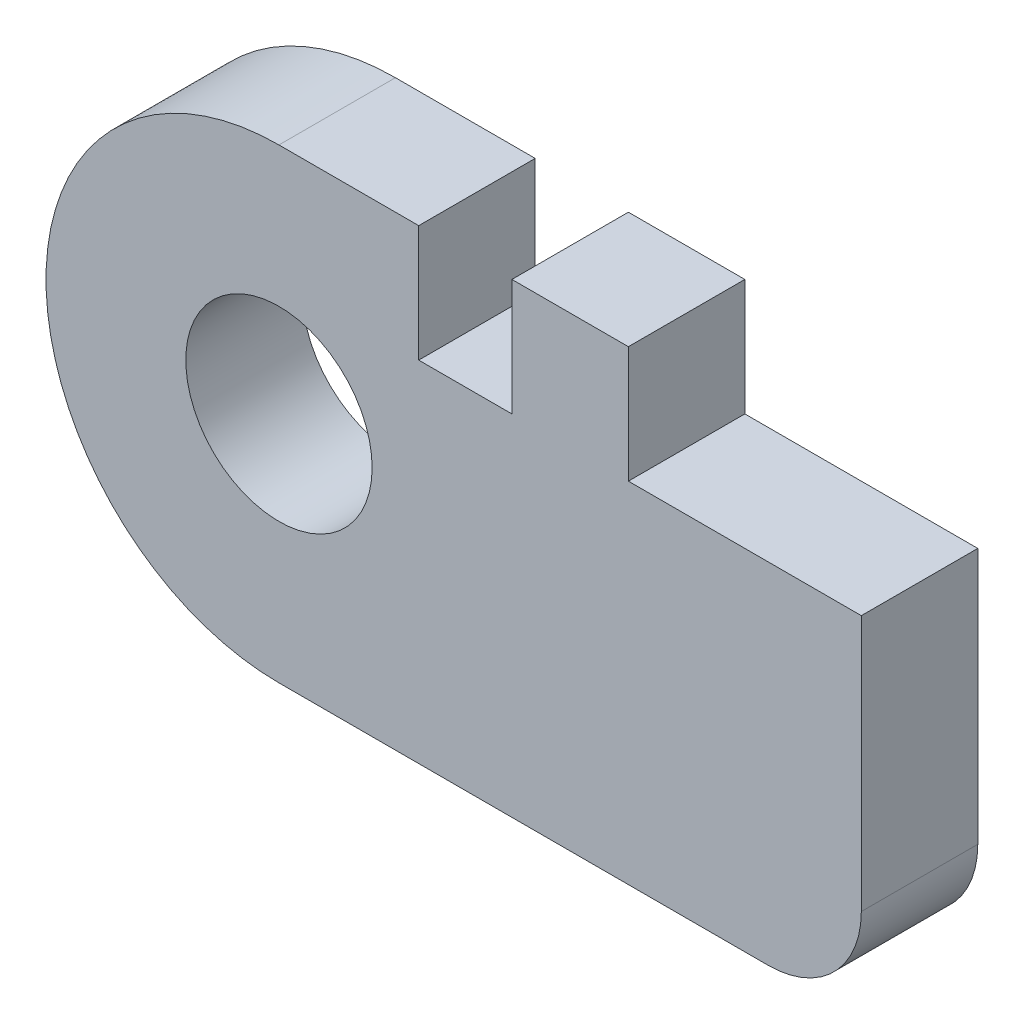
ISO-10303-21;
HEADER;
FILE_DESCRIPTION(('STEP AP214'),'2;1');
FILE_NAME('part.step','',(''),(''),'','','');
FILE_SCHEMA(('AUTOMOTIVE_DESIGN { 1 0 10303 214 1 1 1 1 }'));
ENDSEC;
DATA;
#1=APPLICATION_CONTEXT('core data for automotive mechanical design processes');
#2=APPLICATION_PROTOCOL_DEFINITION('international standard','automotive_design',2000,#1);
#3=PRODUCT_CONTEXT('',#1,'mechanical');
#4=PRODUCT('Part','Part','',(#3));
#5=PRODUCT_RELATED_PRODUCT_CATEGORY('part','',(#4));
#6=PRODUCT_DEFINITION_FORMATION('','',#4);
#7=PRODUCT_DEFINITION_CONTEXT('part definition',#1,'design');
#8=PRODUCT_DEFINITION('design','',#6,#7);
#9=PRODUCT_DEFINITION_SHAPE('','',#8);
#10=(LENGTH_UNIT() NAMED_UNIT(*) SI_UNIT(.MILLI.,.METRE.));
#11=(NAMED_UNIT(*) PLANE_ANGLE_UNIT() SI_UNIT($,.RADIAN.));
#12=(NAMED_UNIT(*) SI_UNIT($,.STERADIAN.) SOLID_ANGLE_UNIT());
#13=UNCERTAINTY_MEASURE_WITH_UNIT(LENGTH_MEASURE(1.E-05),#10,'distance_accuracy_value','');
#14=(GEOMETRIC_REPRESENTATION_CONTEXT(3) GLOBAL_UNCERTAINTY_ASSIGNED_CONTEXT((#13)) GLOBAL_UNIT_ASSIGNED_CONTEXT((#10,
#11,#12)) REPRESENTATION_CONTEXT('',''));
#15=CARTESIAN_POINT('',(0.,0.,0.));
#16=DIRECTION('',(0.,0.,1.));
#17=DIRECTION('',(1.,0.,0.));
#18=AXIS2_PLACEMENT_3D('',#15,#16,#17);
#19=CARTESIAN_POINT('',(18.5,-6.,5.));
#20=DIRECTION('',(0.,0.,-1.));
#21=DIRECTION('',(-1.,0.,0.));
#22=AXIS2_PLACEMENT_3D('',#19,#20,#21);
#23=PLANE('',#22);
#24=CARTESIAN_POINT('',(18.5,-6.,5.));
#25=DIRECTION('',(0.,0.,1.));
#26=DIRECTION('',(-1.,0.,0.));
#27=AXIS2_PLACEMENT_3D('',#24,#25,#26);
#28=CIRCLE('',#27,4.);
#29=CARTESIAN_POINT('',(18.5,-10.,5.));
#30=VERTEX_POINT('',#29);
#31=CARTESIAN_POINT('',(22.5,-5.99999999999997,5.));
#32=VERTEX_POINT('',#31);
#33=EDGE_CURVE('E168',#30,#32,#28,.T.);
#34=ORIENTED_EDGE('',*,*,#33,.T.);
#35=DIRECTION('',(0.,1.,0.));
#36=VECTOR('',#35,1.);
#37=CARTESIAN_POINT('',(22.5,5.,5.));
#38=LINE('',#37,#36);
#39=CARTESIAN_POINT('',(22.5,5.,5.));
#40=VERTEX_POINT('',#39);
#41=EDGE_CURVE('E101',#32,#40,#38,.T.);
#42=ORIENTED_EDGE('',*,*,#41,.T.);
#43=DIRECTION('',(-1.,0.,0.));
#44=VECTOR('',#43,1.);
#45=CARTESIAN_POINT('',(12.5,5.,5.));
#46=LINE('',#45,#44);
#47=CARTESIAN_POINT('',(12.5,5.,5.));
#48=VERTEX_POINT('',#47);
#49=EDGE_CURVE('E192',#40,#48,#46,.T.);
#50=ORIENTED_EDGE('',*,*,#49,.T.);
#51=DIRECTION('',(0.,1.,0.));
#52=VECTOR('',#51,1.);
#53=CARTESIAN_POINT('',(12.5,10.,5.));
#54=LINE('',#53,#52);
#55=CARTESIAN_POINT('',(12.5,10.,5.));
#56=VERTEX_POINT('',#55);
#57=EDGE_CURVE('E211',#48,#56,#54,.T.);
#58=ORIENTED_EDGE('',*,*,#57,.T.);
#59=DIRECTION('',(-1.,0.,0.));
#60=VECTOR('',#59,1.);
#61=CARTESIAN_POINT('',(7.5,10.,5.));
#62=LINE('',#61,#60);
#63=CARTESIAN_POINT('',(7.5,10.,5.));
#64=VERTEX_POINT('',#63);
#65=EDGE_CURVE('E208',#56,#64,#62,.T.);
#66=ORIENTED_EDGE('',*,*,#65,.T.);
#67=DIRECTION('',(0.,-1.,0.));
#68=VECTOR('',#67,1.);
#69=CARTESIAN_POINT('',(7.5,5.,5.));
#70=LINE('',#69,#68);
#71=CARTESIAN_POINT('',(7.5,5.,5.));
#72=VERTEX_POINT('',#71);
#73=EDGE_CURVE('E210',#64,#72,#70,.T.);
#74=ORIENTED_EDGE('',*,*,#73,.T.);
#75=DIRECTION('',(-1.,0.,0.));
#76=VECTOR('',#75,1.);
#77=CARTESIAN_POINT('',(7.5,5.,5.));
#78=LINE('',#77,#76);
#79=CARTESIAN_POINT('',(3.5,5.,5.));
#80=VERTEX_POINT('',#79);
#81=EDGE_CURVE('E213',#72,#80,#78,.T.);
#82=ORIENTED_EDGE('',*,*,#81,.T.);
#83=DIRECTION('',(0.,1.,0.));
#84=VECTOR('',#83,1.);
#85=CARTESIAN_POINT('',(3.5,10.,5.));
#86=LINE('',#85,#84);
#87=CARTESIAN_POINT('',(3.5,10.,5.));
#88=VERTEX_POINT('',#87);
#89=EDGE_CURVE('E129',#80,#88,#86,.T.);
#90=ORIENTED_EDGE('',*,*,#89,.T.);
#91=DIRECTION('',(-1.,0.,0.));
#92=VECTOR('',#91,1.);
#93=CARTESIAN_POINT('',(3.5,10.,5.));
#94=LINE('',#93,#92);
#95=CARTESIAN_POINT('',(-2.50000000000004,10.,5.));
#96=VERTEX_POINT('',#95);
#97=EDGE_CURVE('E123',#88,#96,#94,.T.);
#98=ORIENTED_EDGE('',*,*,#97,.T.);
#99=CARTESIAN_POINT('',(-2.5,0.,5.));
#100=DIRECTION('',(0.,0.,1.));
#101=DIRECTION('',(1.,0.,0.));
#102=AXIS2_PLACEMENT_3D('',#99,#100,#101);
#103=CIRCLE('',#102,10.);
#104=CARTESIAN_POINT('',(-2.5,-10.,5.));
#105=VERTEX_POINT('',#104);
#106=EDGE_CURVE('E127',#96,#105,#103,.T.);
#107=ORIENTED_EDGE('',*,*,#106,.T.);
#108=DIRECTION('',(1.,0.,0.));
#109=VECTOR('',#108,1.);
#110=CARTESIAN_POINT('',(18.5,-10.,5.));
#111=LINE('',#110,#109);
#112=EDGE_CURVE('E49',#105,#30,#111,.T.);
#113=ORIENTED_EDGE('',*,*,#112,.T.);
#114=EDGE_LOOP('',(#34,#42,#50,#58,#66,#74,#82,#90,#98,#107,#113));
#115=FACE_BOUND('',#114,.T.);
#116=CARTESIAN_POINT('',(-2.5,0.,5.));
#117=DIRECTION('',(0.,0.,1.));
#118=DIRECTION('',(1.,0.,0.));
#119=AXIS2_PLACEMENT_3D('',#116,#117,#118);
#120=CIRCLE('',#119,4.);
#121=CARTESIAN_POINT('',(1.5,0.,5.));
#122=VERTEX_POINT('',#121);
#123=EDGE_CURVE('E151',#122,#122,#120,.T.);
#124=ORIENTED_EDGE('',*,*,#123,.F.);
#125=EDGE_LOOP('',(#124));
#126=FACE_BOUND('',#125,.T.);
#127=ADVANCED_FACE('F32',(#115,#126),#23,.F.);
#128=CARTESIAN_POINT('',(18.5,-6.,0.));
#129=DIRECTION('',(0.,0.,-1.));
#130=DIRECTION('',(-1.,0.,0.));
#131=AXIS2_PLACEMENT_3D('',#128,#129,#130);
#132=PLANE('',#131);
#133=CARTESIAN_POINT('',(18.5,-6.,0.));
#134=DIRECTION('',(0.,0.,1.));
#135=DIRECTION('',(-1.,0.,0.));
#136=AXIS2_PLACEMENT_3D('',#133,#134,#135);
#137=CIRCLE('',#136,4.);
#138=CARTESIAN_POINT('',(18.5,-10.,0.));
#139=VERTEX_POINT('',#138);
#140=CARTESIAN_POINT('',(22.5,-5.99999999999997,0.));
#141=VERTEX_POINT('',#140);
#142=EDGE_CURVE('E147',#139,#141,#137,.T.);
#143=ORIENTED_EDGE('',*,*,#142,.F.);
#144=DIRECTION('',(1.,0.,0.));
#145=VECTOR('',#144,1.);
#146=CARTESIAN_POINT('',(18.5,-10.,0.));
#147=LINE('',#146,#145);
#148=CARTESIAN_POINT('',(-2.5,-10.,0.));
#149=VERTEX_POINT('',#148);
#150=EDGE_CURVE('E93',#149,#139,#147,.T.);
#151=ORIENTED_EDGE('',*,*,#150,.F.);
#152=CARTESIAN_POINT('',(-2.5,0.,0.));
#153=DIRECTION('',(0.,0.,1.));
#154=DIRECTION('',(1.,0.,0.));
#155=AXIS2_PLACEMENT_3D('',#152,#153,#154);
#156=CIRCLE('',#155,10.);
#157=CARTESIAN_POINT('',(-2.50000000000004,10.,0.));
#158=VERTEX_POINT('',#157);
#159=EDGE_CURVE('E87',#158,#149,#156,.T.);
#160=ORIENTED_EDGE('',*,*,#159,.F.);
#161=DIRECTION('',(-1.,0.,0.));
#162=VECTOR('',#161,1.);
#163=CARTESIAN_POINT('',(3.5,10.,0.));
#164=LINE('',#163,#162);
#165=CARTESIAN_POINT('',(3.5,10.,0.));
#166=VERTEX_POINT('',#165);
#167=EDGE_CURVE('E137',#166,#158,#164,.T.);
#168=ORIENTED_EDGE('',*,*,#167,.F.);
#169=DIRECTION('',(0.,1.,0.));
#170=VECTOR('',#169,1.);
#171=CARTESIAN_POINT('',(3.5,10.,0.));
#172=LINE('',#171,#170);
#173=CARTESIAN_POINT('',(3.5,5.,0.));
#174=VERTEX_POINT('',#173);
#175=EDGE_CURVE('E163',#174,#166,#172,.T.);
#176=ORIENTED_EDGE('',*,*,#175,.F.);
#177=DIRECTION('',(-1.,0.,0.));
#178=VECTOR('',#177,1.);
#179=CARTESIAN_POINT('',(7.5,5.,0.));
#180=LINE('',#179,#178);
#181=CARTESIAN_POINT('',(7.5,5.,0.));
#182=VERTEX_POINT('',#181);
#183=EDGE_CURVE('E161',#182,#174,#180,.T.);
#184=ORIENTED_EDGE('',*,*,#183,.F.);
#185=DIRECTION('',(0.,-1.,0.));
#186=VECTOR('',#185,1.);
#187=CARTESIAN_POINT('',(7.5,5.,0.));
#188=LINE('',#187,#186);
#189=CARTESIAN_POINT('',(7.5,10.,0.));
#190=VERTEX_POINT('',#189);
#191=EDGE_CURVE('E159',#190,#182,#188,.T.);
#192=ORIENTED_EDGE('',*,*,#191,.F.);
#193=DIRECTION('',(-1.,0.,0.));
#194=VECTOR('',#193,1.);
#195=CARTESIAN_POINT('',(7.5,10.,0.));
#196=LINE('',#195,#194);
#197=CARTESIAN_POINT('',(12.5,10.,0.));
#198=VERTEX_POINT('',#197);
#199=EDGE_CURVE('E157',#198,#190,#196,.T.);
#200=ORIENTED_EDGE('',*,*,#199,.F.);
#201=DIRECTION('',(0.,1.,0.));
#202=VECTOR('',#201,1.);
#203=CARTESIAN_POINT('',(12.5,10.,0.));
#204=LINE('',#203,#202);
#205=CARTESIAN_POINT('',(12.5,5.,0.));
#206=VERTEX_POINT('',#205);
#207=EDGE_CURVE('E155',#206,#198,#204,.T.);
#208=ORIENTED_EDGE('',*,*,#207,.F.);
#209=DIRECTION('',(-1.,0.,0.));
#210=VECTOR('',#209,1.);
#211=CARTESIAN_POINT('',(12.5,5.,0.));
#212=LINE('',#211,#210);
#213=CARTESIAN_POINT('',(22.5,5.,0.));
#214=VERTEX_POINT('',#213);
#215=EDGE_CURVE('E153',#214,#206,#212,.T.);
#216=ORIENTED_EDGE('',*,*,#215,.F.);
#217=DIRECTION('',(0.,1.,0.));
#218=VECTOR('',#217,1.);
#219=CARTESIAN_POINT('',(22.5,5.,0.));
#220=LINE('',#219,#218);
#221=EDGE_CURVE('E150',#141,#214,#220,.T.);
#222=ORIENTED_EDGE('',*,*,#221,.F.);
#223=EDGE_LOOP('',(#143,#151,#160,#168,#176,#184,#192,#200,#208,#216,#222));
#224=FACE_BOUND('',#223,.T.);
#225=CARTESIAN_POINT('',(-2.5,0.,0.));
#226=DIRECTION('',(0.,0.,1.));
#227=DIRECTION('',(1.,0.,0.));
#228=AXIS2_PLACEMENT_3D('',#225,#226,#227);
#229=CIRCLE('',#228,4.);
#230=CARTESIAN_POINT('',(1.5,0.,0.));
#231=VERTEX_POINT('',#230);
#232=EDGE_CURVE('E351',#231,#231,#229,.T.);
#233=ORIENTED_EDGE('',*,*,#232,.T.);
#234=EDGE_LOOP('',(#233));
#235=FACE_BOUND('',#234,.T.);
#236=ADVANCED_FACE('F196',(#224,#235),#132,.T.);
#237=CARTESIAN_POINT('',(18.5,-6.,5.));
#238=DIRECTION('',(0.,0.,-1.));
#239=DIRECTION('',(-1.,0.,0.));
#240=AXIS2_PLACEMENT_3D('',#237,#238,#239);
#241=CYLINDRICAL_SURFACE('',#240,4.);
#242=ORIENTED_EDGE('',*,*,#142,.T.);
#243=DIRECTION('',(0.,0.,-1.));
#244=VECTOR('',#243,1.);
#245=CARTESIAN_POINT('',(22.5,-5.99999999999997,5.));
#246=LINE('',#245,#244);
#247=EDGE_CURVE('E11',#32,#141,#246,.T.);
#248=ORIENTED_EDGE('',*,*,#247,.F.);
#249=ORIENTED_EDGE('',*,*,#33,.F.);
#250=DIRECTION('',(0.,0.,-1.));
#251=VECTOR('',#250,1.);
#252=CARTESIAN_POINT('',(18.5,-10.,5.));
#253=LINE('',#252,#251);
#254=EDGE_CURVE('E143',#30,#139,#253,.T.);
#255=ORIENTED_EDGE('',*,*,#254,.T.);
#256=EDGE_LOOP('',(#242,#248,#249,#255));
#257=FACE_BOUND('',#256,.T.);
#258=ADVANCED_FACE('F34',(#257),#241,.T.);
#259=CARTESIAN_POINT('',(22.5,5.,5.));
#260=DIRECTION('',(-1.,0.,0.));
#261=DIRECTION('',(0.,0.,1.));
#262=AXIS2_PLACEMENT_3D('',#259,#260,#261);
#263=PLANE('',#262);
#264=ORIENTED_EDGE('',*,*,#221,.T.);
#265=DIRECTION('',(0.,0.,-1.));
#266=VECTOR('',#265,1.);
#267=CARTESIAN_POINT('',(22.5,5.,5.));
#268=LINE('',#267,#266);
#269=EDGE_CURVE('E41',#40,#214,#268,.T.);
#270=ORIENTED_EDGE('',*,*,#269,.F.);
#271=ORIENTED_EDGE('',*,*,#41,.F.);
#272=ORIENTED_EDGE('',*,*,#247,.T.);
#273=EDGE_LOOP('',(#264,#270,#271,#272));
#274=FACE_BOUND('',#273,.T.);
#275=ADVANCED_FACE('F250',(#274),#263,.F.);
#276=CARTESIAN_POINT('',(12.5,5.,5.));
#277=DIRECTION('',(0.,-1.,0.));
#278=DIRECTION('',(0.,0.,-1.));
#279=AXIS2_PLACEMENT_3D('',#276,#277,#278);
#280=PLANE('',#279);
#281=ORIENTED_EDGE('',*,*,#215,.T.);
#282=DIRECTION('',(0.,0.,-1.));
#283=VECTOR('',#282,1.);
#284=CARTESIAN_POINT('',(12.5,5.,5.));
#285=LINE('',#284,#283);
#286=EDGE_CURVE('E184',#48,#206,#285,.T.);
#287=ORIENTED_EDGE('',*,*,#286,.F.);
#288=ORIENTED_EDGE('',*,*,#49,.F.);
#289=ORIENTED_EDGE('',*,*,#269,.T.);
#290=EDGE_LOOP('',(#281,#287,#288,#289));
#291=FACE_BOUND('',#290,.T.);
#292=ADVANCED_FACE('F190',(#291),#280,.F.);
#293=CARTESIAN_POINT('',(12.5,10.,5.));
#294=DIRECTION('',(-1.,0.,0.));
#295=DIRECTION('',(0.,-1.,0.));
#296=AXIS2_PLACEMENT_3D('',#293,#294,#295);
#297=PLANE('',#296);
#298=ORIENTED_EDGE('',*,*,#207,.T.);
#299=DIRECTION('',(0.,0.,-1.));
#300=VECTOR('',#299,1.);
#301=CARTESIAN_POINT('',(12.5,10.,5.));
#302=LINE('',#301,#300);
#303=EDGE_CURVE('E181',#56,#198,#302,.T.);
#304=ORIENTED_EDGE('',*,*,#303,.F.);
#305=ORIENTED_EDGE('',*,*,#57,.F.);
#306=ORIENTED_EDGE('',*,*,#286,.T.);
#307=EDGE_LOOP('',(#298,#304,#305,#306));
#308=FACE_BOUND('',#307,.T.);
#309=ADVANCED_FACE('F202',(#308),#297,.F.);
#310=CARTESIAN_POINT('',(7.5,10.,5.));
#311=DIRECTION('',(0.,-1.,0.));
#312=DIRECTION('',(0.,0.,-1.));
#313=AXIS2_PLACEMENT_3D('',#310,#311,#312);
#314=PLANE('',#313);
#315=ORIENTED_EDGE('',*,*,#199,.T.);
#316=DIRECTION('',(0.,0.,-1.));
#317=VECTOR('',#316,1.);
#318=CARTESIAN_POINT('',(7.5,10.,5.));
#319=LINE('',#318,#317);
#320=EDGE_CURVE('E178',#64,#190,#319,.T.);
#321=ORIENTED_EDGE('',*,*,#320,.F.);
#322=ORIENTED_EDGE('',*,*,#65,.F.);
#323=ORIENTED_EDGE('',*,*,#303,.T.);
#324=EDGE_LOOP('',(#315,#321,#322,#323));
#325=FACE_BOUND('',#324,.T.);
#326=ADVANCED_FACE('F206',(#325),#314,.F.);
#327=CARTESIAN_POINT('',(7.5,5.,5.));
#328=DIRECTION('',(1.,0.,0.));
#329=DIRECTION('',(0.,0.,-1.));
#330=AXIS2_PLACEMENT_3D('',#327,#328,#329);
#331=PLANE('',#330);
#332=ORIENTED_EDGE('',*,*,#191,.T.);
#333=DIRECTION('',(0.,0.,-1.));
#334=VECTOR('',#333,1.);
#335=CARTESIAN_POINT('',(7.5,5.,5.));
#336=LINE('',#335,#334);
#337=EDGE_CURVE('E175',#72,#182,#336,.T.);
#338=ORIENTED_EDGE('',*,*,#337,.F.);
#339=ORIENTED_EDGE('',*,*,#73,.F.);
#340=ORIENTED_EDGE('',*,*,#320,.T.);
#341=EDGE_LOOP('',(#332,#338,#339,#340));
#342=FACE_BOUND('',#341,.T.);
#343=ADVANCED_FACE('F263',(#342),#331,.F.);
#344=CARTESIAN_POINT('',(7.5,5.,5.));
#345=DIRECTION('',(0.,-1.,0.));
#346=DIRECTION('',(1.,0.,0.));
#347=AXIS2_PLACEMENT_3D('',#344,#345,#346);
#348=PLANE('',#347);
#349=ORIENTED_EDGE('',*,*,#183,.T.);
#350=DIRECTION('',(0.,0.,-1.));
#351=VECTOR('',#350,1.);
#352=CARTESIAN_POINT('',(3.5,5.,5.));
#353=LINE('',#352,#351);
#354=EDGE_CURVE('E172',#80,#174,#353,.T.);
#355=ORIENTED_EDGE('',*,*,#354,.F.);
#356=ORIENTED_EDGE('',*,*,#81,.F.);
#357=ORIENTED_EDGE('',*,*,#337,.T.);
#358=EDGE_LOOP('',(#349,#355,#356,#357));
#359=FACE_BOUND('',#358,.T.);
#360=ADVANCED_FACE('F222',(#359),#348,.F.);
#361=CARTESIAN_POINT('',(3.5,10.,5.));
#362=DIRECTION('',(-1.,0.,0.));
#363=DIRECTION('',(0.,0.,1.));
#364=AXIS2_PLACEMENT_3D('',#361,#362,#363);
#365=PLANE('',#364);
#366=ORIENTED_EDGE('',*,*,#175,.T.);
#367=DIRECTION('',(0.,0.,-1.));
#368=VECTOR('',#367,1.);
#369=CARTESIAN_POINT('',(3.5,10.,5.));
#370=LINE('',#369,#368);
#371=EDGE_CURVE('E138',#88,#166,#370,.T.);
#372=ORIENTED_EDGE('',*,*,#371,.F.);
#373=ORIENTED_EDGE('',*,*,#89,.F.);
#374=ORIENTED_EDGE('',*,*,#354,.T.);
#375=EDGE_LOOP('',(#366,#372,#373,#374));
#376=FACE_BOUND('',#375,.T.);
#377=ADVANCED_FACE('F226',(#376),#365,.F.);
#378=CARTESIAN_POINT('',(3.5,10.,5.));
#379=DIRECTION('',(0.,-1.,0.));
#380=DIRECTION('',(0.,0.,-1.));
#381=AXIS2_PLACEMENT_3D('',#378,#379,#380);
#382=PLANE('',#381);
#383=ORIENTED_EDGE('',*,*,#167,.T.);
#384=DIRECTION('',(0.,0.,-1.));
#385=VECTOR('',#384,1.);
#386=CARTESIAN_POINT('',(-2.50000000000004,10.,5.));
#387=LINE('',#386,#385);
#388=EDGE_CURVE('E134',#96,#158,#387,.T.);
#389=ORIENTED_EDGE('',*,*,#388,.F.);
#390=ORIENTED_EDGE('',*,*,#97,.F.);
#391=ORIENTED_EDGE('',*,*,#371,.T.);
#392=EDGE_LOOP('',(#383,#389,#390,#391));
#393=FACE_BOUND('',#392,.T.);
#394=ADVANCED_FACE('F135',(#393),#382,.F.);
#395=CARTESIAN_POINT('',(-2.5,0.,5.));
#396=DIRECTION('',(0.,0.,-1.));
#397=DIRECTION('',(-1.,0.,0.));
#398=AXIS2_PLACEMENT_3D('',#395,#396,#397);
#399=CYLINDRICAL_SURFACE('',#398,10.);
#400=ORIENTED_EDGE('',*,*,#159,.T.);
#401=DIRECTION('',(0.,0.,-1.));
#402=VECTOR('',#401,1.);
#403=CARTESIAN_POINT('',(-2.5,-10.,5.));
#404=LINE('',#403,#402);
#405=EDGE_CURVE('E139',#105,#149,#404,.T.);
#406=ORIENTED_EDGE('',*,*,#405,.F.);
#407=ORIENTED_EDGE('',*,*,#106,.F.);
#408=ORIENTED_EDGE('',*,*,#388,.T.);
#409=EDGE_LOOP('',(#400,#406,#407,#408));
#410=FACE_BOUND('',#409,.T.);
#411=ADVANCED_FACE('F141',(#410),#399,.T.);
#412=CARTESIAN_POINT('',(18.5,-10.,5.));
#413=DIRECTION('',(0.,1.,0.));
#414=DIRECTION('',(0.,0.,1.));
#415=AXIS2_PLACEMENT_3D('',#412,#413,#414);
#416=PLANE('',#415);
#417=ORIENTED_EDGE('',*,*,#150,.T.);
#418=ORIENTED_EDGE('',*,*,#254,.F.);
#419=ORIENTED_EDGE('',*,*,#112,.F.);
#420=ORIENTED_EDGE('',*,*,#405,.T.);
#421=EDGE_LOOP('',(#417,#418,#419,#420));
#422=FACE_BOUND('',#421,.T.);
#423=ADVANCED_FACE('F230',(#422),#416,.F.);
#424=CARTESIAN_POINT('',(-2.5,0.,5.));
#425=DIRECTION('',(0.,0.,-1.));
#426=DIRECTION('',(-1.,0.,0.));
#427=AXIS2_PLACEMENT_3D('',#424,#425,#426);
#428=CYLINDRICAL_SURFACE('',#427,4.);
#429=ORIENTED_EDGE('',*,*,#123,.T.);
#430=EDGE_LOOP('',(#429));
#431=FACE_BOUND('',#430,.T.);
#432=ORIENTED_EDGE('',*,*,#232,.F.);
#433=EDGE_LOOP('',(#432));
#434=FACE_BOUND('',#433,.T.);
#435=ADVANCED_FACE('F232',(#431,#434),#428,.F.);
#436=CLOSED_SHELL('',(#127,#236,#258,#275,#292,#309,#326,#343,#360,#377,#394,#411,#423,#435));
#437=MANIFOLD_SOLID_BREP('B2',#436);
#438=ADVANCED_BREP_SHAPE_REPRESENTATION('',(#18,#437),#14);
#439=SHAPE_DEFINITION_REPRESENTATION(#9,#438);
ENDSEC;
END-ISO-10303-21;
